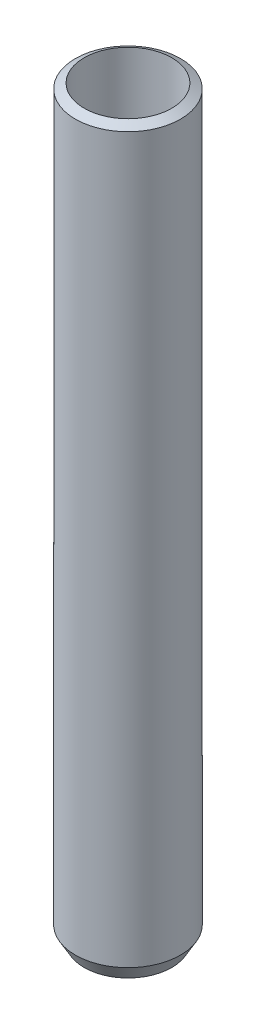
ISO-10303-21;
HEADER;
FILE_DESCRIPTION(('STEP AP214'),'2;1');
FILE_NAME('part.step','',(''),(''),'','','');
FILE_SCHEMA(('AUTOMOTIVE_DESIGN { 1 0 10303 214 1 1 1 1 }'));
ENDSEC;
DATA;
#1=APPLICATION_CONTEXT('core data for automotive mechanical design processes');
#2=APPLICATION_PROTOCOL_DEFINITION('international standard','automotive_design',2000,#1);
#3=PRODUCT_CONTEXT('',#1,'mechanical');
#4=PRODUCT('Part','Part','',(#3));
#5=PRODUCT_RELATED_PRODUCT_CATEGORY('part','',(#4));
#6=PRODUCT_DEFINITION_FORMATION('','',#4);
#7=PRODUCT_DEFINITION_CONTEXT('part definition',#1,'design');
#8=PRODUCT_DEFINITION('design','',#6,#7);
#9=PRODUCT_DEFINITION_SHAPE('','',#8);
#10=(LENGTH_UNIT() NAMED_UNIT(*) SI_UNIT(.MILLI.,.METRE.));
#11=(NAMED_UNIT(*) PLANE_ANGLE_UNIT() SI_UNIT($,.RADIAN.));
#12=(NAMED_UNIT(*) SI_UNIT($,.STERADIAN.) SOLID_ANGLE_UNIT());
#13=UNCERTAINTY_MEASURE_WITH_UNIT(LENGTH_MEASURE(1.E-05),#10,'distance_accuracy_value','');
#14=(GEOMETRIC_REPRESENTATION_CONTEXT(3) GLOBAL_UNCERTAINTY_ASSIGNED_CONTEXT((#13)) GLOBAL_UNIT_ASSIGNED_CONTEXT((#10,
#11,#12)) REPRESENTATION_CONTEXT('',''));
#15=CARTESIAN_POINT('',(0.,0.,0.));
#16=DIRECTION('',(0.,0.,1.));
#17=DIRECTION('',(1.,0.,0.));
#18=AXIS2_PLACEMENT_3D('',#15,#16,#17);
#19=CARTESIAN_POINT('',(0.,427.485477895035,0.));
#20=DIRECTION('',(0.,-1.,0.));
#21=DIRECTION('',(0.,0.,-1.));
#22=AXIS2_PLACEMENT_3D('',#19,#20,#21);
#23=CYLINDRICAL_SURFACE('',#22,30.);
#24=CARTESIAN_POINT('',(0.,422.288826613574,0.));
#25=DIRECTION('',(0.,1.,0.));
#26=DIRECTION('',(0.,0.,1.));
#27=AXIS2_PLACEMENT_3D('',#24,#25,#26);
#28=CIRCLE('',#27,30.);
#29=CARTESIAN_POINT('',(0.,422.288826613574,30.));
#30=VERTEX_POINT('',#29);
#31=EDGE_CURVE('E10',#30,#30,#28,.F.);
#32=ORIENTED_EDGE('',*,*,#31,.T.);
#33=EDGE_LOOP('',(#32));
#34=FACE_BOUND('',#33,.T.);
#35=CARTESIAN_POINT('',(0.,9.00086404870787,0.));
#36=DIRECTION('',(0.,1.,0.));
#37=DIRECTION('',(0.,0.,1.));
#38=AXIS2_PLACEMENT_3D('',#35,#36,#37);
#39=CIRCLE('',#38,30.);
#40=CARTESIAN_POINT('',(0.,9.00086404870787,30.));
#41=VERTEX_POINT('',#40);
#42=EDGE_CURVE('E50',#41,#41,#39,.T.);
#43=ORIENTED_EDGE('',*,*,#42,.T.);
#44=EDGE_LOOP('',(#43));
#45=FACE_BOUND('',#44,.T.);
#46=ADVANCED_FACE('F39',(#34,#45),#23,.T.);
#47=CARTESIAN_POINT('',(0.,427.485477895035,0.));
#48=DIRECTION('',(0.,-1.,0.));
#49=DIRECTION('',(0.,0.,-1.));
#50=AXIS2_PLACEMENT_3D('',#47,#48,#49);
#51=CYLINDRICAL_SURFACE('',#50,25.0044642258057);
#52=CARTESIAN_POINT('',(0.,425.173000537552,0.));
#53=DIRECTION('',(0.,-1.,0.));
#54=DIRECTION('',(0.,0.,-1.));
#55=AXIS2_PLACEMENT_3D('',#52,#53,#54);
#56=CIRCLE('',#55,25.0044642258057);
#57=CARTESIAN_POINT('',(0.,425.173000537552,-25.0044642258057));
#58=VERTEX_POINT('',#57);
#59=EDGE_CURVE('E51',#58,#58,#56,.F.);
#60=ORIENTED_EDGE('',*,*,#59,.T.);
#61=EDGE_LOOP('',(#60));
#62=FACE_BOUND('',#61,.T.);
#63=CARTESIAN_POINT('',(0.,0.348342276775335,0.));
#64=DIRECTION('',(0.,1.,0.));
#65=DIRECTION('',(0.,0.,1.));
#66=AXIS2_PLACEMENT_3D('',#63,#64,#65);
#67=CIRCLE('',#66,25.0044642258057);
#68=CARTESIAN_POINT('',(0.,0.348342276775335,25.0044642258057));
#69=VERTEX_POINT('',#68);
#70=EDGE_CURVE('E54',#69,#69,#67,.F.);
#71=ORIENTED_EDGE('',*,*,#70,.T.);
#72=EDGE_LOOP('',(#71));
#73=FACE_BOUND('',#72,.T.);
#74=ADVANCED_FACE('F63',(#62,#73),#51,.F.);
#75=CARTESIAN_POINT('',(0.,427.485477895035,0.));
#76=DIRECTION('',(0.,-1.,0.));
#77=DIRECTION('',(0.,0.,-1.));
#78=AXIS2_PLACEMENT_3D('',#75,#76,#77);
#79=CONICAL_SURFACE('',#78,20.9991359512921,1.0471975511966);
#80=ORIENTED_EDGE('',*,*,#31,.F.);
#81=EDGE_LOOP('',(#80));
#82=FACE_BOUND('',#81,.T.);
#83=ORIENTED_EDGE('',*,*,#59,.F.);
#84=EDGE_LOOP('',(#83));
#85=FACE_BOUND('',#84,.T.);
#86=ADVANCED_FACE('F64',(#82,#85),#79,.T.);
#87=CARTESIAN_POINT('',(0.,9.00086404870787,0.));
#88=DIRECTION('',(0.,1.,0.));
#89=DIRECTION('',(0.,0.,1.));
#90=AXIS2_PLACEMENT_3D('',#87,#88,#89);
#91=CONICAL_SURFACE('',#90,30.,0.523598775598296);
#92=ORIENTED_EDGE('',*,*,#70,.F.);
#93=EDGE_LOOP('',(#92));
#94=FACE_BOUND('',#93,.T.);
#95=ORIENTED_EDGE('',*,*,#42,.F.);
#96=EDGE_LOOP('',(#95));
#97=FACE_BOUND('',#96,.T.);
#98=ADVANCED_FACE('F45',(#94,#97),#91,.T.);
#99=CLOSED_SHELL('',(#46,#74,#86,#98));
#100=MANIFOLD_SOLID_BREP('B2',#99);
#101=ADVANCED_BREP_SHAPE_REPRESENTATION('',(#18,#100),#14);
#102=SHAPE_DEFINITION_REPRESENTATION(#9,#101);
ENDSEC;
END-ISO-10303-21;
